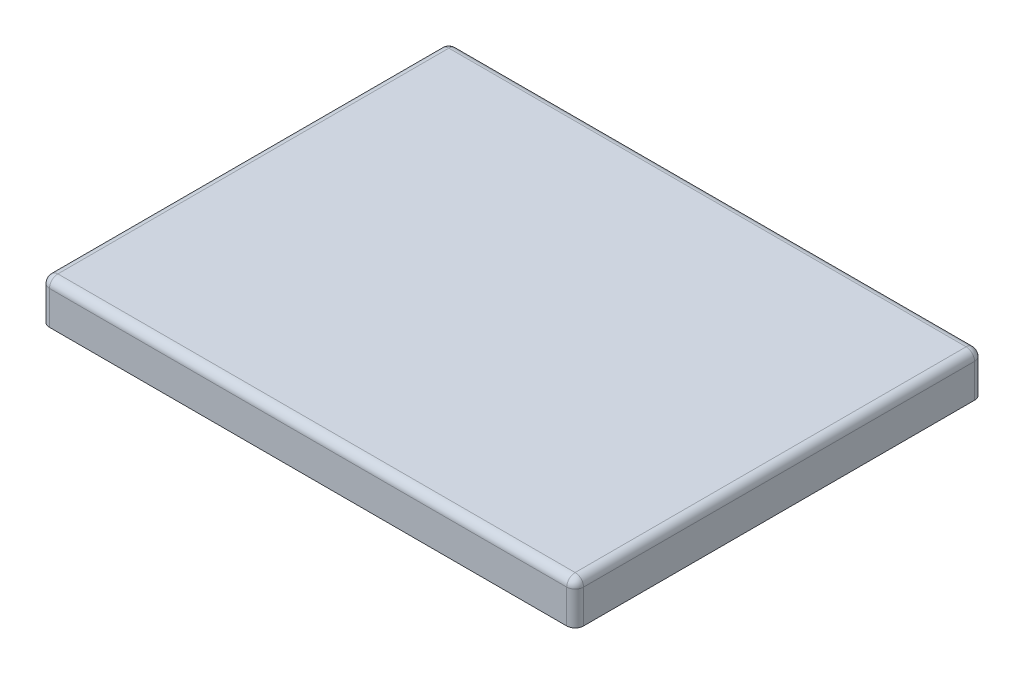
ISO-10303-21;
HEADER;
FILE_DESCRIPTION(('STEP AP214'),'2;1');
FILE_NAME('part.step','',(''),(''),'','','');
FILE_SCHEMA(('AUTOMOTIVE_DESIGN { 1 0 10303 214 1 1 1 1 }'));
ENDSEC;
DATA;
#1=APPLICATION_CONTEXT('core data for automotive mechanical design processes');
#2=APPLICATION_PROTOCOL_DEFINITION('international standard','automotive_design',2000,#1);
#3=PRODUCT_CONTEXT('',#1,'mechanical');
#4=PRODUCT('Part','Part','',(#3));
#5=PRODUCT_RELATED_PRODUCT_CATEGORY('part','',(#4));
#6=PRODUCT_DEFINITION_FORMATION('','',#4);
#7=PRODUCT_DEFINITION_CONTEXT('part definition',#1,'design');
#8=PRODUCT_DEFINITION('design','',#6,#7);
#9=PRODUCT_DEFINITION_SHAPE('','',#8);
#10=(LENGTH_UNIT() NAMED_UNIT(*) SI_UNIT(.MILLI.,.METRE.));
#11=(NAMED_UNIT(*) PLANE_ANGLE_UNIT() SI_UNIT($,.RADIAN.));
#12=(NAMED_UNIT(*) SI_UNIT($,.STERADIAN.) SOLID_ANGLE_UNIT());
#13=UNCERTAINTY_MEASURE_WITH_UNIT(LENGTH_MEASURE(1.E-05),#10,'distance_accuracy_value','');
#14=(GEOMETRIC_REPRESENTATION_CONTEXT(3) GLOBAL_UNCERTAINTY_ASSIGNED_CONTEXT((#13)) GLOBAL_UNIT_ASSIGNED_CONTEXT((#10,
#11,#12)) REPRESENTATION_CONTEXT('',''));
#15=CARTESIAN_POINT('',(0.,0.,0.));
#16=DIRECTION('',(0.,0.,1.));
#17=DIRECTION('',(1.,0.,0.));
#18=AXIS2_PLACEMENT_3D('',#15,#16,#17);
#19=CARTESIAN_POINT('',(0.,50.8,0.));
#20=DIRECTION('',(0.,1.,0.));
#21=DIRECTION('',(0.,0.,1.));
#22=AXIS2_PLACEMENT_3D('',#19,#20,#21);
#23=PLANE('',#22);
#24=DIRECTION('',(-1.,0.,0.));
#25=VECTOR('',#24,1.);
#26=CARTESIAN_POINT('',(-322.2625,50.8,-235.9025));
#27=LINE('',#26,#25);
#28=CARTESIAN_POINT('',(312.1025,50.8,-235.9025));
#29=VERTEX_POINT('',#28);
#30=CARTESIAN_POINT('',(-312.1025,50.8,-235.9025));
#31=VERTEX_POINT('',#30);
#32=EDGE_CURVE('E42',#29,#31,#27,.T.);
#33=ORIENTED_EDGE('',*,*,#32,.T.);
#34=DIRECTION('',(0.,0.,1.));
#35=VECTOR('',#34,1.);
#36=CARTESIAN_POINT('',(-312.1025,50.8,246.0625));
#37=LINE('',#36,#35);
#38=CARTESIAN_POINT('',(-312.1025,50.8,235.9025));
#39=VERTEX_POINT('',#38);
#40=EDGE_CURVE('E11',#31,#39,#37,.T.);
#41=ORIENTED_EDGE('',*,*,#40,.T.);
#42=DIRECTION('',(1.,0.,0.));
#43=VECTOR('',#42,1.);
#44=CARTESIAN_POINT('',(322.2625,50.8,235.9025));
#45=LINE('',#44,#43);
#46=CARTESIAN_POINT('',(312.1025,50.8,235.9025));
#47=VERTEX_POINT('',#46);
#48=EDGE_CURVE('E198',#39,#47,#45,.T.);
#49=ORIENTED_EDGE('',*,*,#48,.T.);
#50=DIRECTION('',(0.,0.,-1.));
#51=VECTOR('',#50,1.);
#52=CARTESIAN_POINT('',(312.1025,50.8,-246.0625));
#53=LINE('',#52,#51);
#54=EDGE_CURVE('E53',#47,#29,#53,.T.);
#55=ORIENTED_EDGE('',*,*,#54,.T.);
#56=EDGE_LOOP('',(#33,#41,#49,#55));
#57=FACE_BOUND('',#56,.T.);
#58=ADVANCED_FACE('F33',(#57),#23,.T.);
#59=CARTESIAN_POINT('',(0.,0.,0.));
#60=DIRECTION('',(0.,1.,0.));
#61=DIRECTION('',(0.,0.,1.));
#62=AXIS2_PLACEMENT_3D('',#59,#60,#61);
#63=PLANE('',#62);
#64=DIRECTION('',(1.,0.,0.));
#65=VECTOR('',#64,1.);
#66=CARTESIAN_POINT('',(-322.2625,0.,246.0625));
#67=LINE('',#66,#65);
#68=CARTESIAN_POINT('',(-312.1025,0.,246.0625));
#69=VERTEX_POINT('',#68);
#70=CARTESIAN_POINT('',(312.1025,0.,246.0625));
#71=VERTEX_POINT('',#70);
#72=EDGE_CURVE('E159',#69,#71,#67,.T.);
#73=ORIENTED_EDGE('',*,*,#72,.F.);
#74=CARTESIAN_POINT('',(-312.1025,0.,235.9025));
#75=DIRECTION('',(0.,1.,0.));
#76=DIRECTION('',(0.,0.,1.));
#77=AXIS2_PLACEMENT_3D('',#74,#75,#76);
#78=CIRCLE('',#77,10.16);
#79=CARTESIAN_POINT('',(-322.2625,0.,235.9025));
#80=VERTEX_POINT('',#79);
#81=EDGE_CURVE('E178',#69,#80,#78,.F.);
#82=ORIENTED_EDGE('',*,*,#81,.T.);
#83=DIRECTION('',(0.,0.,1.));
#84=VECTOR('',#83,1.);
#85=CARTESIAN_POINT('',(-322.2625,0.,-246.0625));
#86=LINE('',#85,#84);
#87=CARTESIAN_POINT('',(-322.2625,0.,-235.9025));
#88=VERTEX_POINT('',#87);
#89=EDGE_CURVE('E164',#88,#80,#86,.T.);
#90=ORIENTED_EDGE('',*,*,#89,.F.);
#91=CARTESIAN_POINT('',(-312.1025,0.,-235.9025));
#92=DIRECTION('',(0.,1.,0.));
#93=DIRECTION('',(0.,0.,1.));
#94=AXIS2_PLACEMENT_3D('',#91,#92,#93);
#95=CIRCLE('',#94,10.16);
#96=CARTESIAN_POINT('',(-312.1025,0.,-246.0625));
#97=VERTEX_POINT('',#96);
#98=EDGE_CURVE('E172',#88,#97,#95,.F.);
#99=ORIENTED_EDGE('',*,*,#98,.T.);
#100=DIRECTION('',(-1.,0.,0.));
#101=VECTOR('',#100,1.);
#102=CARTESIAN_POINT('',(-322.2625,0.,-246.0625));
#103=LINE('',#102,#101);
#104=CARTESIAN_POINT('',(312.1025,0.,-246.0625));
#105=VERTEX_POINT('',#104);
#106=EDGE_CURVE('E248',#105,#97,#103,.T.);
#107=ORIENTED_EDGE('',*,*,#106,.F.);
#108=CARTESIAN_POINT('',(312.1025,0.,-235.9025));
#109=DIRECTION('',(0.,1.,0.));
#110=DIRECTION('',(0.,0.,1.));
#111=AXIS2_PLACEMENT_3D('',#108,#109,#110);
#112=CIRCLE('',#111,10.16);
#113=CARTESIAN_POINT('',(322.2625,0.,-235.9025));
#114=VERTEX_POINT('',#113);
#115=EDGE_CURVE('E174',#105,#114,#112,.F.);
#116=ORIENTED_EDGE('',*,*,#115,.T.);
#117=DIRECTION('',(0.,0.,-1.));
#118=VECTOR('',#117,1.);
#119=CARTESIAN_POINT('',(322.2625,0.,-246.0625));
#120=LINE('',#119,#118);
#121=CARTESIAN_POINT('',(322.2625,0.,235.9025));
#122=VERTEX_POINT('',#121);
#123=EDGE_CURVE('E258',#122,#114,#120,.T.);
#124=ORIENTED_EDGE('',*,*,#123,.F.);
#125=CARTESIAN_POINT('',(312.1025,0.,235.9025));
#126=DIRECTION('',(0.,1.,0.));
#127=DIRECTION('',(0.,0.,1.));
#128=AXIS2_PLACEMENT_3D('',#125,#126,#127);
#129=CIRCLE('',#128,10.16);
#130=EDGE_CURVE('E176',#122,#71,#129,.F.);
#131=ORIENTED_EDGE('',*,*,#130,.T.);
#132=EDGE_LOOP('',(#73,#82,#90,#99,#107,#116,#124,#131));
#133=FACE_BOUND('',#132,.T.);
#134=DIRECTION('',(0.,0.,-1.));
#135=VECTOR('',#134,1.);
#136=CARTESIAN_POINT('',(317.5,0.,-241.3));
#137=LINE('',#136,#135);
#138=CARTESIAN_POINT('',(317.5,0.,241.3));
#139=VERTEX_POINT('',#138);
#140=CARTESIAN_POINT('',(317.5,0.,-241.3));
#141=VERTEX_POINT('',#140);
#142=EDGE_CURVE('E273',#139,#141,#137,.T.);
#143=ORIENTED_EDGE('',*,*,#142,.T.);
#144=DIRECTION('',(-1.,0.,0.));
#145=VECTOR('',#144,1.);
#146=CARTESIAN_POINT('',(-317.5,0.,-241.3));
#147=LINE('',#146,#145);
#148=CARTESIAN_POINT('',(-317.5,0.,-241.3));
#149=VERTEX_POINT('',#148);
#150=EDGE_CURVE('E270',#141,#149,#147,.T.);
#151=ORIENTED_EDGE('',*,*,#150,.T.);
#152=DIRECTION('',(0.,0.,1.));
#153=VECTOR('',#152,1.);
#154=CARTESIAN_POINT('',(-317.5,0.,-241.3));
#155=LINE('',#154,#153);
#156=CARTESIAN_POINT('',(-317.5,0.,241.3));
#157=VERTEX_POINT('',#156);
#158=EDGE_CURVE('E268',#149,#157,#155,.T.);
#159=ORIENTED_EDGE('',*,*,#158,.T.);
#160=DIRECTION('',(1.,0.,0.));
#161=VECTOR('',#160,1.);
#162=CARTESIAN_POINT('',(-317.5,0.,241.3));
#163=LINE('',#162,#161);
#164=EDGE_CURVE('E140',#157,#139,#163,.T.);
#165=ORIENTED_EDGE('',*,*,#164,.T.);
#166=EDGE_LOOP('',(#143,#151,#159,#165));
#167=FACE_BOUND('',#166,.T.);
#168=ADVANCED_FACE('F252',(#133,#167),#63,.F.);
#169=CARTESIAN_POINT('',(322.2625,50.8,-246.0625));
#170=DIRECTION('',(-1.,0.,0.));
#171=DIRECTION('',(0.,0.,1.));
#172=AXIS2_PLACEMENT_3D('',#169,#170,#171);
#173=PLANE('',#172);
#174=DIRECTION('',(0.,0.,-1.));
#175=VECTOR('',#174,1.);
#176=CARTESIAN_POINT('',(322.2625,40.64,246.0625));
#177=LINE('',#176,#175);
#178=CARTESIAN_POINT('',(322.2625,40.64,-235.9025));
#179=VERTEX_POINT('',#178);
#180=CARTESIAN_POINT('',(322.2625,40.64,235.9025));
#181=VERTEX_POINT('',#180);
#182=EDGE_CURVE('E186',#179,#181,#177,.F.);
#183=ORIENTED_EDGE('',*,*,#182,.T.);
#184=DIRECTION('',(0.,-1.,0.));
#185=VECTOR('',#184,1.);
#186=CARTESIAN_POINT('',(322.2625,50.8,235.9025));
#187=LINE('',#186,#185);
#188=EDGE_CURVE('E190',#181,#122,#187,.T.);
#189=ORIENTED_EDGE('',*,*,#188,.T.);
#190=ORIENTED_EDGE('',*,*,#123,.T.);
#191=DIRECTION('',(0.,-1.,0.));
#192=VECTOR('',#191,1.);
#193=CARTESIAN_POINT('',(322.2625,50.8,-235.9025));
#194=LINE('',#193,#192);
#195=EDGE_CURVE('E188',#114,#179,#194,.F.);
#196=ORIENTED_EDGE('',*,*,#195,.T.);
#197=EDGE_LOOP('',(#183,#189,#190,#196));
#198=FACE_BOUND('',#197,.T.);
#199=ADVANCED_FACE('F285',(#198),#173,.F.);
#200=CARTESIAN_POINT('',(-322.2625,50.8,-246.0625));
#201=DIRECTION('',(0.,0.,1.));
#202=DIRECTION('',(1.,0.,0.));
#203=AXIS2_PLACEMENT_3D('',#200,#201,#202);
#204=PLANE('',#203);
#205=DIRECTION('',(-1.,0.,0.));
#206=VECTOR('',#205,1.);
#207=CARTESIAN_POINT('',(322.2625,40.64,-246.0625));
#208=LINE('',#207,#206);
#209=CARTESIAN_POINT('',(-312.1025,40.64,-246.0625));
#210=VERTEX_POINT('',#209);
#211=CARTESIAN_POINT('',(312.1025,40.64,-246.0625));
#212=VERTEX_POINT('',#211);
#213=EDGE_CURVE('E192',#210,#212,#208,.F.);
#214=ORIENTED_EDGE('',*,*,#213,.T.);
#215=DIRECTION('',(0.,-1.,0.));
#216=VECTOR('',#215,1.);
#217=CARTESIAN_POINT('',(312.1025,50.8,-246.0625));
#218=LINE('',#217,#216);
#219=EDGE_CURVE('E196',#212,#105,#218,.T.);
#220=ORIENTED_EDGE('',*,*,#219,.T.);
#221=ORIENTED_EDGE('',*,*,#106,.T.);
#222=DIRECTION('',(0.,-1.,0.));
#223=VECTOR('',#222,1.);
#224=CARTESIAN_POINT('',(-312.1025,50.8,-246.0625));
#225=LINE('',#224,#223);
#226=EDGE_CURVE('E194',#97,#210,#225,.F.);
#227=ORIENTED_EDGE('',*,*,#226,.T.);
#228=EDGE_LOOP('',(#214,#220,#221,#227));
#229=FACE_BOUND('',#228,.T.);
#230=ADVANCED_FACE('F247',(#229),#204,.F.);
#231=CARTESIAN_POINT('',(-322.2625,50.8,-246.0625));
#232=DIRECTION('',(1.,0.,0.));
#233=DIRECTION('',(0.,0.,-1.));
#234=AXIS2_PLACEMENT_3D('',#231,#232,#233);
#235=PLANE('',#234);
#236=ORIENTED_EDGE('',*,*,#89,.T.);
#237=DIRECTION('',(0.,-1.,0.));
#238=VECTOR('',#237,1.);
#239=CARTESIAN_POINT('',(-322.2625,50.8,235.9025));
#240=LINE('',#239,#238);
#241=CARTESIAN_POINT('',(-322.2625,40.64,235.9025));
#242=VERTEX_POINT('',#241);
#243=EDGE_CURVE('E184',#80,#242,#240,.F.);
#244=ORIENTED_EDGE('',*,*,#243,.T.);
#245=DIRECTION('',(0.,0.,1.));
#246=VECTOR('',#245,1.);
#247=CARTESIAN_POINT('',(-322.2625,40.64,-246.0625));
#248=LINE('',#247,#246);
#249=CARTESIAN_POINT('',(-322.2625,40.64,-235.9025));
#250=VERTEX_POINT('',#249);
#251=EDGE_CURVE('E180',#242,#250,#248,.F.);
#252=ORIENTED_EDGE('',*,*,#251,.T.);
#253=DIRECTION('',(0.,-1.,0.));
#254=VECTOR('',#253,1.);
#255=CARTESIAN_POINT('',(-322.2625,50.8,-235.9025));
#256=LINE('',#255,#254);
#257=EDGE_CURVE('E182',#250,#88,#256,.T.);
#258=ORIENTED_EDGE('',*,*,#257,.T.);
#259=EDGE_LOOP('',(#236,#244,#252,#258));
#260=FACE_BOUND('',#259,.T.);
#261=ADVANCED_FACE('F299',(#260),#235,.F.);
#262=CARTESIAN_POINT('',(-322.2625,50.8,246.0625));
#263=DIRECTION('',(0.,0.,-1.));
#264=DIRECTION('',(-1.,0.,0.));
#265=AXIS2_PLACEMENT_3D('',#262,#263,#264);
#266=PLANE('',#265);
#267=DIRECTION('',(1.,0.,0.));
#268=VECTOR('',#267,1.);
#269=CARTESIAN_POINT('',(-322.2625,40.64,246.0625));
#270=LINE('',#269,#268);
#271=CARTESIAN_POINT('',(312.1025,40.64,246.0625));
#272=VERTEX_POINT('',#271);
#273=CARTESIAN_POINT('',(-312.1025,40.64,246.0625));
#274=VERTEX_POINT('',#273);
#275=EDGE_CURVE('E158',#272,#274,#270,.F.);
#276=ORIENTED_EDGE('',*,*,#275,.T.);
#277=DIRECTION('',(0.,-1.,0.));
#278=VECTOR('',#277,1.);
#279=CARTESIAN_POINT('',(-312.1025,50.8,246.0625));
#280=LINE('',#279,#278);
#281=EDGE_CURVE('E169',#274,#69,#280,.T.);
#282=ORIENTED_EDGE('',*,*,#281,.T.);
#283=ORIENTED_EDGE('',*,*,#72,.T.);
#284=DIRECTION('',(0.,-1.,0.));
#285=VECTOR('',#284,1.);
#286=CARTESIAN_POINT('',(312.1025,50.8,246.0625));
#287=LINE('',#286,#285);
#288=EDGE_CURVE('E161',#71,#272,#287,.F.);
#289=ORIENTED_EDGE('',*,*,#288,.T.);
#290=EDGE_LOOP('',(#276,#282,#283,#289));
#291=FACE_BOUND('',#290,.T.);
#292=ADVANCED_FACE('F296',(#291),#266,.F.);
#293=CARTESIAN_POINT('',(317.5,50.8,-241.3));
#294=DIRECTION('',(-1.,0.,0.));
#295=DIRECTION('',(0.,0.,1.));
#296=AXIS2_PLACEMENT_3D('',#293,#294,#295);
#297=PLANE('',#296);
#298=DIRECTION('',(0.,0.,1.));
#299=VECTOR('',#298,1.);
#300=CARTESIAN_POINT('',(317.5,46.0375,-241.3));
#301=LINE('',#300,#299);
#302=CARTESIAN_POINT('',(317.5,46.0375,-241.3));
#303=VERTEX_POINT('',#302);
#304=CARTESIAN_POINT('',(317.5,46.0375,241.3));
#305=VERTEX_POINT('',#304);
#306=EDGE_CURVE('E157',#303,#305,#301,.T.);
#307=ORIENTED_EDGE('',*,*,#306,.F.);
#308=DIRECTION('',(0.,-1.,0.));
#309=VECTOR('',#308,1.);
#310=CARTESIAN_POINT('',(317.5,50.8,-241.3));
#311=LINE('',#310,#309);
#312=EDGE_CURVE('E261',#303,#141,#311,.T.);
#313=ORIENTED_EDGE('',*,*,#312,.T.);
#314=ORIENTED_EDGE('',*,*,#142,.F.);
#315=DIRECTION('',(0.,-1.,0.));
#316=VECTOR('',#315,1.);
#317=CARTESIAN_POINT('',(317.5,50.8,241.3));
#318=LINE('',#317,#316);
#319=EDGE_CURVE('E145',#305,#139,#318,.T.);
#320=ORIENTED_EDGE('',*,*,#319,.F.);
#321=EDGE_LOOP('',(#307,#313,#314,#320));
#322=FACE_BOUND('',#321,.T.);
#323=ADVANCED_FACE('F283',(#322),#297,.T.);
#324=CARTESIAN_POINT('',(-317.5,50.8,-241.3));
#325=DIRECTION('',(0.,0.,1.));
#326=DIRECTION('',(1.,0.,0.));
#327=AXIS2_PLACEMENT_3D('',#324,#325,#326);
#328=PLANE('',#327);
#329=DIRECTION('',(1.,0.,0.));
#330=VECTOR('',#329,1.);
#331=CARTESIAN_POINT('',(-317.5,46.0375,-241.3));
#332=LINE('',#331,#330);
#333=CARTESIAN_POINT('',(-317.5,46.0375,-241.3));
#334=VERTEX_POINT('',#333);
#335=EDGE_CURVE('E153',#334,#303,#332,.T.);
#336=ORIENTED_EDGE('',*,*,#335,.F.);
#337=DIRECTION('',(0.,-1.,0.));
#338=VECTOR('',#337,1.);
#339=CARTESIAN_POINT('',(-317.5,50.8,-241.3));
#340=LINE('',#339,#338);
#341=EDGE_CURVE('E144',#334,#149,#340,.T.);
#342=ORIENTED_EDGE('',*,*,#341,.T.);
#343=ORIENTED_EDGE('',*,*,#150,.F.);
#344=ORIENTED_EDGE('',*,*,#312,.F.);
#345=EDGE_LOOP('',(#336,#342,#343,#344));
#346=FACE_BOUND('',#345,.T.);
#347=ADVANCED_FACE('F279',(#346),#328,.T.);
#348=CARTESIAN_POINT('',(-317.5,50.8,-241.3));
#349=DIRECTION('',(1.,0.,0.));
#350=DIRECTION('',(0.,0.,-1.));
#351=AXIS2_PLACEMENT_3D('',#348,#349,#350);
#352=PLANE('',#351);
#353=DIRECTION('',(0.,0.,-1.));
#354=VECTOR('',#353,1.);
#355=CARTESIAN_POINT('',(-317.5,46.0375,-241.3));
#356=LINE('',#355,#354);
#357=CARTESIAN_POINT('',(-317.5,46.0375,241.3));
#358=VERTEX_POINT('',#357);
#359=EDGE_CURVE('E149',#358,#334,#356,.T.);
#360=ORIENTED_EDGE('',*,*,#359,.F.);
#361=DIRECTION('',(0.,-1.,0.));
#362=VECTOR('',#361,1.);
#363=CARTESIAN_POINT('',(-317.5,50.8,241.3));
#364=LINE('',#363,#362);
#365=EDGE_CURVE('E133',#358,#157,#364,.T.);
#366=ORIENTED_EDGE('',*,*,#365,.T.);
#367=ORIENTED_EDGE('',*,*,#158,.F.);
#368=ORIENTED_EDGE('',*,*,#341,.F.);
#369=EDGE_LOOP('',(#360,#366,#367,#368));
#370=FACE_BOUND('',#369,.T.);
#371=ADVANCED_FACE('F150',(#370),#352,.T.);
#372=CARTESIAN_POINT('',(-317.5,50.8,241.3));
#373=DIRECTION('',(0.,0.,-1.));
#374=DIRECTION('',(-1.,0.,0.));
#375=AXIS2_PLACEMENT_3D('',#372,#373,#374);
#376=PLANE('',#375);
#377=DIRECTION('',(-1.,0.,0.));
#378=VECTOR('',#377,1.);
#379=CARTESIAN_POINT('',(-317.5,46.0375,241.3));
#380=LINE('',#379,#378);
#381=EDGE_CURVE('E137',#305,#358,#380,.T.);
#382=ORIENTED_EDGE('',*,*,#381,.F.);
#383=ORIENTED_EDGE('',*,*,#319,.T.);
#384=ORIENTED_EDGE('',*,*,#164,.F.);
#385=ORIENTED_EDGE('',*,*,#365,.F.);
#386=EDGE_LOOP('',(#382,#383,#384,#385));
#387=FACE_BOUND('',#386,.T.);
#388=ADVANCED_FACE('F135',(#387),#376,.T.);
#389=CARTESIAN_POINT('',(-322.2625,46.0375,246.0625));
#390=DIRECTION('',(0.,-1.,0.));
#391=DIRECTION('',(0.,0.,-1.));
#392=AXIS2_PLACEMENT_3D('',#389,#390,#391);
#393=PLANE('',#392);
#394=ORIENTED_EDGE('',*,*,#335,.T.);
#395=ORIENTED_EDGE('',*,*,#306,.T.);
#396=ORIENTED_EDGE('',*,*,#381,.T.);
#397=ORIENTED_EDGE('',*,*,#359,.T.);
#398=EDGE_LOOP('',(#394,#395,#396,#397));
#399=FACE_BOUND('',#398,.T.);
#400=ADVANCED_FACE('F156',(#399),#393,.T.);
#401=CARTESIAN_POINT('',(312.1025,50.8,-235.9025));
#402=DIRECTION('',(0.,-1.,0.));
#403=DIRECTION('',(0.,0.,-1.));
#404=AXIS2_PLACEMENT_3D('',#401,#402,#403);
#405=CYLINDRICAL_SURFACE('',#404,10.16);
#406=CARTESIAN_POINT('',(312.1025,40.64,-235.9025));
#407=DIRECTION('',(0.,1.,0.));
#408=DIRECTION('',(0.,0.,1.));
#409=AXIS2_PLACEMENT_3D('',#406,#407,#408);
#410=CIRCLE('',#409,10.16);
#411=EDGE_CURVE('E37',#179,#212,#410,.T.);
#412=ORIENTED_EDGE('',*,*,#411,.F.);
#413=ORIENTED_EDGE('',*,*,#195,.F.);
#414=ORIENTED_EDGE('',*,*,#115,.F.);
#415=ORIENTED_EDGE('',*,*,#219,.F.);
#416=EDGE_LOOP('',(#412,#413,#414,#415));
#417=FACE_BOUND('',#416,.T.);
#418=ADVANCED_FACE('F35',(#417),#405,.T.);
#419=CARTESIAN_POINT('',(312.1025,40.64,-235.9025));
#420=DIRECTION('',(0.,0.,1.));
#421=DIRECTION('',(1.,0.,0.));
#422=AXIS2_PLACEMENT_3D('',#419,#420,#421);
#423=SPHERICAL_SURFACE('',#422,10.16);
#424=CARTESIAN_POINT('',(312.1025,40.64,-235.9025));
#425=DIRECTION('',(0.,0.,-1.));
#426=DIRECTION('',(-1.,0.,0.));
#427=AXIS2_PLACEMENT_3D('',#424,#425,#426);
#428=CIRCLE('',#427,10.16);
#429=EDGE_CURVE('E228',#179,#29,#428,.F.);
#430=ORIENTED_EDGE('',*,*,#429,.F.);
#431=ORIENTED_EDGE('',*,*,#411,.T.);
#432=CARTESIAN_POINT('',(312.1025,40.64,-235.9025));
#433=DIRECTION('',(1.,0.,0.));
#434=DIRECTION('',(0.,1.,0.));
#435=AXIS2_PLACEMENT_3D('',#432,#433,#434);
#436=CIRCLE('',#435,10.16);
#437=EDGE_CURVE('E229',#29,#212,#436,.F.);
#438=ORIENTED_EDGE('',*,*,#437,.F.);
#439=EDGE_LOOP('',(#430,#431,#438));
#440=FACE_BOUND('',#439,.T.);
#441=ADVANCED_FACE('F238',(#440),#423,.T.);
#442=CARTESIAN_POINT('',(-312.1025,50.8,-235.9025));
#443=DIRECTION('',(0.,-1.,0.));
#444=DIRECTION('',(0.,0.,-1.));
#445=AXIS2_PLACEMENT_3D('',#442,#443,#444);
#446=CYLINDRICAL_SURFACE('',#445,10.16);
#447=ORIENTED_EDGE('',*,*,#98,.F.);
#448=ORIENTED_EDGE('',*,*,#257,.F.);
#449=CARTESIAN_POINT('',(-312.1025,40.64,-235.9025));
#450=DIRECTION('',(0.,1.,0.));
#451=DIRECTION('',(0.,0.,1.));
#452=AXIS2_PLACEMENT_3D('',#449,#450,#451);
#453=CIRCLE('',#452,10.16);
#454=EDGE_CURVE('E225',#210,#250,#453,.T.);
#455=ORIENTED_EDGE('',*,*,#454,.F.);
#456=ORIENTED_EDGE('',*,*,#226,.F.);
#457=EDGE_LOOP('',(#447,#448,#455,#456));
#458=FACE_BOUND('',#457,.T.);
#459=ADVANCED_FACE('F341',(#458),#446,.T.);
#460=CARTESIAN_POINT('',(0.,40.64,-235.9025));
#461=DIRECTION('',(1.,0.,0.));
#462=DIRECTION('',(0.,0.,-1.));
#463=AXIS2_PLACEMENT_3D('',#460,#461,#462);
#464=CYLINDRICAL_SURFACE('',#463,10.16);
#465=ORIENTED_EDGE('',*,*,#437,.T.);
#466=ORIENTED_EDGE('',*,*,#213,.F.);
#467=CARTESIAN_POINT('',(-312.1025,40.64,-235.9025));
#468=DIRECTION('',(-1.,0.,0.));
#469=DIRECTION('',(0.,0.,1.));
#470=AXIS2_PLACEMENT_3D('',#467,#468,#469);
#471=CIRCLE('',#470,10.16);
#472=EDGE_CURVE('E222',#31,#210,#471,.T.);
#473=ORIENTED_EDGE('',*,*,#472,.F.);
#474=ORIENTED_EDGE('',*,*,#32,.F.);
#475=EDGE_LOOP('',(#465,#466,#473,#474));
#476=FACE_BOUND('',#475,.T.);
#477=ADVANCED_FACE('F337',(#476),#464,.T.);
#478=CARTESIAN_POINT('',(312.1025,40.64,0.));
#479=DIRECTION('',(0.,0.,1.));
#480=DIRECTION('',(1.,0.,0.));
#481=AXIS2_PLACEMENT_3D('',#478,#479,#480);
#482=CYLINDRICAL_SURFACE('',#481,10.16);
#483=ORIENTED_EDGE('',*,*,#429,.T.);
#484=ORIENTED_EDGE('',*,*,#54,.F.);
#485=CARTESIAN_POINT('',(312.1025,40.64,235.9025));
#486=DIRECTION('',(0.,0.,1.));
#487=DIRECTION('',(1.,0.,0.));
#488=AXIS2_PLACEMENT_3D('',#485,#486,#487);
#489=CIRCLE('',#488,10.16);
#490=EDGE_CURVE('E219',#181,#47,#489,.T.);
#491=ORIENTED_EDGE('',*,*,#490,.F.);
#492=ORIENTED_EDGE('',*,*,#182,.F.);
#493=EDGE_LOOP('',(#483,#484,#491,#492));
#494=FACE_BOUND('',#493,.T.);
#495=ADVANCED_FACE('F333',(#494),#482,.T.);
#496=CARTESIAN_POINT('',(312.1025,50.8,235.9025));
#497=DIRECTION('',(0.,-1.,0.));
#498=DIRECTION('',(0.,0.,-1.));
#499=AXIS2_PLACEMENT_3D('',#496,#497,#498);
#500=CYLINDRICAL_SURFACE('',#499,10.16);
#501=ORIENTED_EDGE('',*,*,#130,.F.);
#502=ORIENTED_EDGE('',*,*,#188,.F.);
#503=CARTESIAN_POINT('',(312.1025,40.64,235.9025));
#504=DIRECTION('',(0.,1.,0.));
#505=DIRECTION('',(0.,0.,1.));
#506=AXIS2_PLACEMENT_3D('',#503,#504,#505);
#507=CIRCLE('',#506,10.16);
#508=EDGE_CURVE('E216',#272,#181,#507,.T.);
#509=ORIENTED_EDGE('',*,*,#508,.F.);
#510=ORIENTED_EDGE('',*,*,#288,.F.);
#511=EDGE_LOOP('',(#501,#502,#509,#510));
#512=FACE_BOUND('',#511,.T.);
#513=ADVANCED_FACE('F329',(#512),#500,.T.);
#514=CARTESIAN_POINT('',(-312.1025,40.64,-235.9025));
#515=DIRECTION('',(0.,0.,1.));
#516=DIRECTION('',(1.,0.,0.));
#517=AXIS2_PLACEMENT_3D('',#514,#515,#516);
#518=SPHERICAL_SURFACE('',#517,10.16);
#519=ORIENTED_EDGE('',*,*,#472,.T.);
#520=ORIENTED_EDGE('',*,*,#454,.T.);
#521=CARTESIAN_POINT('',(-312.1025,40.64,-235.9025));
#522=DIRECTION('',(0.,0.,-1.));
#523=DIRECTION('',(-1.,0.,0.));
#524=AXIS2_PLACEMENT_3D('',#521,#522,#523);
#525=CIRCLE('',#524,10.16);
#526=EDGE_CURVE('E213',#31,#250,#525,.F.);
#527=ORIENTED_EDGE('',*,*,#526,.F.);
#528=EDGE_LOOP('',(#519,#520,#527));
#529=FACE_BOUND('',#528,.T.);
#530=ADVANCED_FACE('F325',(#529),#518,.T.);
#531=CARTESIAN_POINT('',(312.1025,40.64,235.9025));
#532=DIRECTION('',(0.,0.,1.));
#533=DIRECTION('',(1.,0.,0.));
#534=AXIS2_PLACEMENT_3D('',#531,#532,#533);
#535=SPHERICAL_SURFACE('',#534,10.16);
#536=ORIENTED_EDGE('',*,*,#508,.T.);
#537=ORIENTED_EDGE('',*,*,#490,.T.);
#538=CARTESIAN_POINT('',(312.1025,40.64,235.9025));
#539=DIRECTION('',(1.,0.,0.));
#540=DIRECTION('',(0.,0.,-1.));
#541=AXIS2_PLACEMENT_3D('',#538,#539,#540);
#542=CIRCLE('',#541,10.16);
#543=EDGE_CURVE('E210',#272,#47,#542,.F.);
#544=ORIENTED_EDGE('',*,*,#543,.F.);
#545=EDGE_LOOP('',(#536,#537,#544));
#546=FACE_BOUND('',#545,.T.);
#547=ADVANCED_FACE('F321',(#546),#535,.T.);
#548=CARTESIAN_POINT('',(-312.1025,40.64,0.));
#549=DIRECTION('',(0.,0.,-1.));
#550=DIRECTION('',(-1.,0.,0.));
#551=AXIS2_PLACEMENT_3D('',#548,#549,#550);
#552=CYLINDRICAL_SURFACE('',#551,10.16);
#553=ORIENTED_EDGE('',*,*,#526,.T.);
#554=ORIENTED_EDGE('',*,*,#251,.F.);
#555=CARTESIAN_POINT('',(-312.1025,40.64,235.9025));
#556=DIRECTION('',(0.,0.,1.));
#557=DIRECTION('',(1.,0.,0.));
#558=AXIS2_PLACEMENT_3D('',#555,#556,#557);
#559=CIRCLE('',#558,10.16);
#560=EDGE_CURVE('E207',#39,#242,#559,.T.);
#561=ORIENTED_EDGE('',*,*,#560,.F.);
#562=ORIENTED_EDGE('',*,*,#40,.F.);
#563=EDGE_LOOP('',(#553,#554,#561,#562));
#564=FACE_BOUND('',#563,.T.);
#565=ADVANCED_FACE('F317',(#564),#552,.T.);
#566=CARTESIAN_POINT('',(0.,40.64,235.9025));
#567=DIRECTION('',(-1.,0.,0.));
#568=DIRECTION('',(0.,0.,1.));
#569=AXIS2_PLACEMENT_3D('',#566,#567,#568);
#570=CYLINDRICAL_SURFACE('',#569,10.16);
#571=ORIENTED_EDGE('',*,*,#543,.T.);
#572=ORIENTED_EDGE('',*,*,#48,.F.);
#573=CARTESIAN_POINT('',(-312.1025,40.64,235.9025));
#574=DIRECTION('',(-1.,0.,0.));
#575=DIRECTION('',(0.,0.,1.));
#576=AXIS2_PLACEMENT_3D('',#573,#574,#575);
#577=CIRCLE('',#576,10.16);
#578=EDGE_CURVE('E205',#274,#39,#577,.T.);
#579=ORIENTED_EDGE('',*,*,#578,.F.);
#580=ORIENTED_EDGE('',*,*,#275,.F.);
#581=EDGE_LOOP('',(#571,#572,#579,#580));
#582=FACE_BOUND('',#581,.T.);
#583=ADVANCED_FACE('F313',(#582),#570,.T.);
#584=CARTESIAN_POINT('',(-312.1025,40.64,235.9025));
#585=DIRECTION('',(0.,0.,1.));
#586=DIRECTION('',(1.,0.,0.));
#587=AXIS2_PLACEMENT_3D('',#584,#585,#586);
#588=SPHERICAL_SURFACE('',#587,10.16);
#589=ORIENTED_EDGE('',*,*,#578,.T.);
#590=ORIENTED_EDGE('',*,*,#560,.T.);
#591=CARTESIAN_POINT('',(-312.1025,40.64,235.9025));
#592=DIRECTION('',(0.,1.,0.));
#593=DIRECTION('',(0.,0.,1.));
#594=AXIS2_PLACEMENT_3D('',#591,#592,#593);
#595=CIRCLE('',#594,10.16);
#596=EDGE_CURVE('E202',#274,#242,#595,.F.);
#597=ORIENTED_EDGE('',*,*,#596,.F.);
#598=EDGE_LOOP('',(#589,#590,#597));
#599=FACE_BOUND('',#598,.T.);
#600=ADVANCED_FACE('F309',(#599),#588,.T.);
#601=CARTESIAN_POINT('',(-312.1025,50.8,235.9025));
#602=DIRECTION('',(0.,-1.,0.));
#603=DIRECTION('',(0.,0.,-1.));
#604=AXIS2_PLACEMENT_3D('',#601,#602,#603);
#605=CYLINDRICAL_SURFACE('',#604,10.16);
#606=ORIENTED_EDGE('',*,*,#596,.T.);
#607=ORIENTED_EDGE('',*,*,#243,.F.);
#608=ORIENTED_EDGE('',*,*,#81,.F.);
#609=ORIENTED_EDGE('',*,*,#281,.F.);
#610=EDGE_LOOP('',(#606,#607,#608,#609));
#611=FACE_BOUND('',#610,.T.);
#612=ADVANCED_FACE('F306',(#611),#605,.T.);
#613=CLOSED_SHELL('',(#58,#168,#199,#230,#261,#292,#323,#347,#371,#388,#400,#418,#441,#459,#477,
#495,#513,#530,#547,#565,#583,#600,#612));
#614=MANIFOLD_SOLID_BREP('B2',#613);
#615=ADVANCED_BREP_SHAPE_REPRESENTATION('',(#18,#614),#14);
#616=SHAPE_DEFINITION_REPRESENTATION(#9,#615);
ENDSEC;
END-ISO-10303-21;
